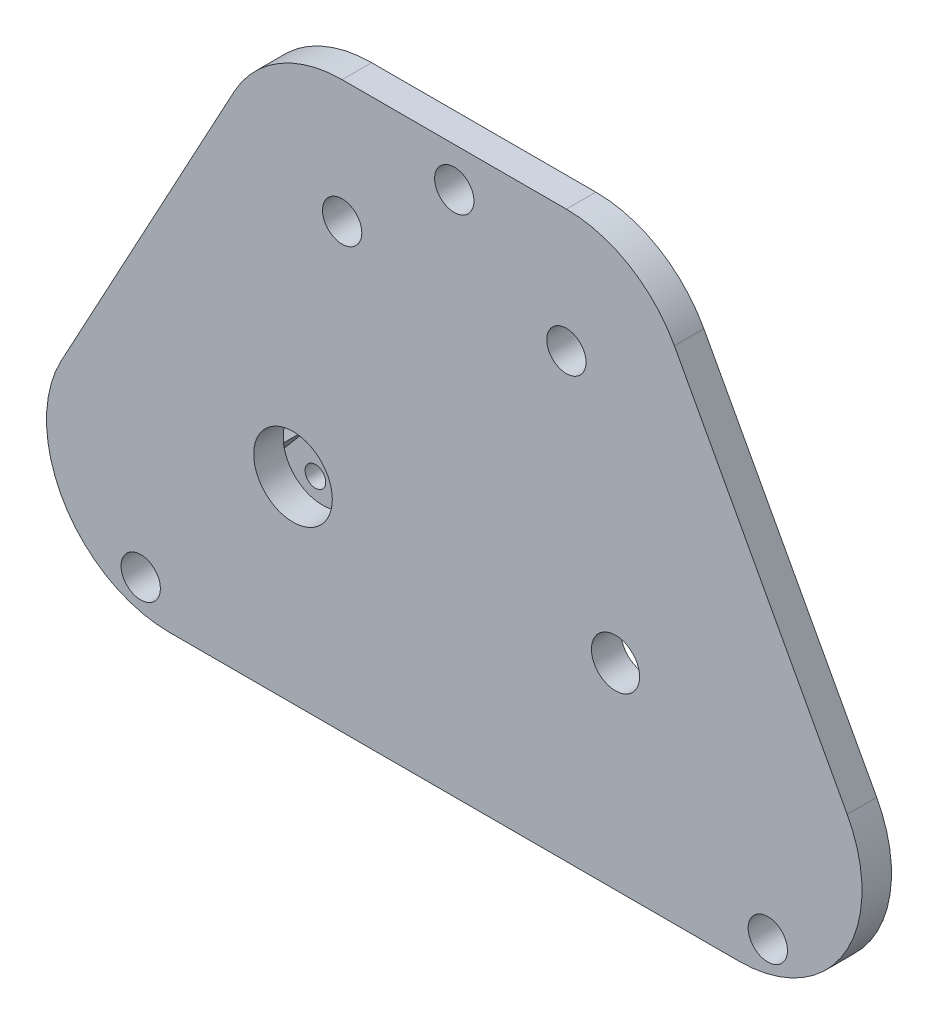
ISO-10303-21;
HEADER;
FILE_DESCRIPTION(('STEP AP214'),'2;1');
FILE_NAME('part.step','',(''),(''),'','','');
FILE_SCHEMA(('AUTOMOTIVE_DESIGN { 1 0 10303 214 1 1 1 1 }'));
ENDSEC;
DATA;
#1=APPLICATION_CONTEXT('core data for automotive mechanical design processes');
#2=APPLICATION_PROTOCOL_DEFINITION('international standard','automotive_design',2000,#1);
#3=PRODUCT_CONTEXT('',#1,'mechanical');
#4=PRODUCT('Part','Part','',(#3));
#5=PRODUCT_RELATED_PRODUCT_CATEGORY('part','',(#4));
#6=PRODUCT_DEFINITION_FORMATION('','',#4);
#7=PRODUCT_DEFINITION_CONTEXT('part definition',#1,'design');
#8=PRODUCT_DEFINITION('design','',#6,#7);
#9=PRODUCT_DEFINITION_SHAPE('','',#8);
#10=(LENGTH_UNIT() NAMED_UNIT(*) SI_UNIT(.MILLI.,.METRE.));
#11=(NAMED_UNIT(*) PLANE_ANGLE_UNIT() SI_UNIT($,.RADIAN.));
#12=(NAMED_UNIT(*) SI_UNIT($,.STERADIAN.) SOLID_ANGLE_UNIT());
#13=UNCERTAINTY_MEASURE_WITH_UNIT(LENGTH_MEASURE(1.E-05),#10,'distance_accuracy_value','');
#14=(GEOMETRIC_REPRESENTATION_CONTEXT(3) GLOBAL_UNCERTAINTY_ASSIGNED_CONTEXT((#13)) GLOBAL_UNIT_ASSIGNED_CONTEXT((#10,
#11,#12)) REPRESENTATION_CONTEXT('',''));
#15=CARTESIAN_POINT('',(0.,0.,0.));
#16=DIRECTION('',(0.,0.,1.));
#17=DIRECTION('',(1.,0.,0.));
#18=AXIS2_PLACEMENT_3D('',#15,#16,#17);
#19=CARTESIAN_POINT('',(11.41,25.,3.));
#20=DIRECTION('',(0.,0.,-1.));
#21=DIRECTION('',(-1.,0.,0.));
#22=AXIS2_PLACEMENT_3D('',#19,#20,#21);
#23=CYLINDRICAL_SURFACE('',#22,12.5);
#24=CARTESIAN_POINT('',(11.41,25.,0.));
#25=DIRECTION('',(0.,0.,1.));
#26=DIRECTION('',(1.,0.,0.));
#27=AXIS2_PLACEMENT_3D('',#24,#25,#26);
#28=CIRCLE('',#27,12.5);
#29=CARTESIAN_POINT('',(22.4037432028954,30.9487486405791,0.));
#30=VERTEX_POINT('',#29);
#31=CARTESIAN_POINT('',(11.41,37.5,0.));
#32=VERTEX_POINT('',#31);
#33=EDGE_CURVE('E336',#30,#32,#28,.T.);
#34=ORIENTED_EDGE('',*,*,#33,.T.);
#35=DIRECTION('',(0.,0.,-1.));
#36=VECTOR('',#35,1.);
#37=CARTESIAN_POINT('',(11.41,37.5,3.));
#38=LINE('',#37,#36);
#39=CARTESIAN_POINT('',(11.41,37.5,3.));
#40=VERTEX_POINT('',#39);
#41=EDGE_CURVE('E11',#40,#32,#38,.T.);
#42=ORIENTED_EDGE('',*,*,#41,.F.);
#43=CARTESIAN_POINT('',(11.41,25.,3.));
#44=DIRECTION('',(0.,0.,1.));
#45=DIRECTION('',(1.,0.,0.));
#46=AXIS2_PLACEMENT_3D('',#43,#44,#45);
#47=CIRCLE('',#46,12.5);
#48=CARTESIAN_POINT('',(22.4037432028954,30.9487486405791,3.));
#49=VERTEX_POINT('',#48);
#50=EDGE_CURVE('E337',#49,#40,#47,.T.);
#51=ORIENTED_EDGE('',*,*,#50,.F.);
#52=DIRECTION('',(0.,0.,-1.));
#53=VECTOR('',#52,1.);
#54=CARTESIAN_POINT('',(22.4037432028954,30.9487486405791,3.));
#55=LINE('',#54,#53);
#56=EDGE_CURVE('E377',#49,#30,#55,.T.);
#57=ORIENTED_EDGE('',*,*,#56,.T.);
#58=EDGE_LOOP('',(#34,#42,#51,#57));
#59=FACE_BOUND('',#58,.T.);
#60=ADVANCED_FACE('F44',(#59),#23,.T.);
#61=CARTESIAN_POINT('',(0.,37.5,3.));
#62=DIRECTION('',(0.,1.,0.));
#63=DIRECTION('',(-1.,0.,0.));
#64=AXIS2_PLACEMENT_3D('',#61,#62,#63);
#65=PLANE('',#64);
#66=DIRECTION('',(1.,0.,0.));
#67=VECTOR('',#66,1.);
#68=CARTESIAN_POINT('',(0.,37.5,0.));
#69=LINE('',#68,#67);
#70=CARTESIAN_POINT('',(-11.41,37.5,0.));
#71=VERTEX_POINT('',#70);
#72=EDGE_CURVE('E380',#71,#32,#69,.T.);
#73=ORIENTED_EDGE('',*,*,#72,.F.);
#74=DIRECTION('',(0.,0.,-1.));
#75=VECTOR('',#74,1.);
#76=CARTESIAN_POINT('',(-11.41,37.5,3.));
#77=LINE('',#76,#75);
#78=CARTESIAN_POINT('',(-11.41,37.5,3.));
#79=VERTEX_POINT('',#78);
#80=EDGE_CURVE('E51',#79,#71,#77,.T.);
#81=ORIENTED_EDGE('',*,*,#80,.F.);
#82=DIRECTION('',(1.,0.,0.));
#83=VECTOR('',#82,1.);
#84=CARTESIAN_POINT('',(0.,37.5,3.));
#85=LINE('',#84,#83);
#86=EDGE_CURVE('E339',#79,#40,#85,.T.);
#87=ORIENTED_EDGE('',*,*,#86,.T.);
#88=ORIENTED_EDGE('',*,*,#41,.T.);
#89=EDGE_LOOP('',(#73,#81,#87,#88));
#90=FACE_BOUND('',#89,.T.);
#91=ADVANCED_FACE('F444',(#90),#65,.T.);
#92=CARTESIAN_POINT('',(-11.41,25.,3.));
#93=DIRECTION('',(0.,0.,-1.));
#94=DIRECTION('',(-1.,0.,0.));
#95=AXIS2_PLACEMENT_3D('',#92,#93,#94);
#96=CYLINDRICAL_SURFACE('',#95,12.5);
#97=CARTESIAN_POINT('',(-11.41,25.,0.));
#98=DIRECTION('',(0.,0.,1.));
#99=DIRECTION('',(1.,0.,0.));
#100=AXIS2_PLACEMENT_3D('',#97,#98,#99);
#101=CIRCLE('',#100,12.5);
#102=CARTESIAN_POINT('',(-22.4037432028954,30.9487486405791,0.));
#103=VERTEX_POINT('',#102);
#104=EDGE_CURVE('E383',#71,#103,#101,.T.);
#105=ORIENTED_EDGE('',*,*,#104,.T.);
#106=DIRECTION('',(0.,0.,-1.));
#107=VECTOR('',#106,1.);
#108=CARTESIAN_POINT('',(-22.4037432028954,30.9487486405791,3.));
#109=LINE('',#108,#107);
#110=CARTESIAN_POINT('',(-22.4037432028954,30.9487486405791,3.));
#111=VERTEX_POINT('',#110);
#112=EDGE_CURVE('E429',#111,#103,#109,.T.);
#113=ORIENTED_EDGE('',*,*,#112,.F.);
#114=CARTESIAN_POINT('',(-11.41,25.,3.));
#115=DIRECTION('',(0.,0.,1.));
#116=DIRECTION('',(1.,0.,0.));
#117=AXIS2_PLACEMENT_3D('',#114,#115,#116);
#118=CIRCLE('',#117,12.5);
#119=EDGE_CURVE('E343',#79,#111,#118,.T.);
#120=ORIENTED_EDGE('',*,*,#119,.F.);
#121=ORIENTED_EDGE('',*,*,#80,.T.);
#122=EDGE_LOOP('',(#105,#113,#120,#121));
#123=FACE_BOUND('',#122,.T.);
#124=ADVANCED_FACE('F434',(#123),#96,.T.);
#125=CARTESIAN_POINT('',(-30.2834407311602,16.3864639692604,3.));
#126=DIRECTION('',(0.879499456231631,-0.475899891246327,0.));
#127=DIRECTION('',(0.475899891246327,0.879499456231631,0.));
#128=AXIS2_PLACEMENT_3D('',#125,#126,#127);
#129=PLANE('',#128);
#130=DIRECTION('',(-0.475899891246327,-0.879499456231631,0.));
#131=VECTOR('',#130,1.);
#132=CARTESIAN_POINT('',(-30.2834407311602,16.3864639692604,0.));
#133=LINE('',#132,#131);
#134=CARTESIAN_POINT('',(-39.9895942866193,-1.55125135942092,0.));
#135=VERTEX_POINT('',#134);
#136=EDGE_CURVE('E385',#103,#135,#133,.T.);
#137=ORIENTED_EDGE('',*,*,#136,.T.);
#138=DIRECTION('',(0.,0.,-1.));
#139=VECTOR('',#138,1.);
#140=CARTESIAN_POINT('',(-39.9895942866193,-1.55125135942092,3.));
#141=LINE('',#140,#139);
#142=CARTESIAN_POINT('',(-39.9895942866193,-1.55125135942092,3.));
#143=VERTEX_POINT('',#142);
#144=EDGE_CURVE('E426',#143,#135,#141,.T.);
#145=ORIENTED_EDGE('',*,*,#144,.F.);
#146=DIRECTION('',(-0.475899891246327,-0.879499456231631,0.));
#147=VECTOR('',#146,1.);
#148=CARTESIAN_POINT('',(-30.2834407311602,16.3864639692604,3.));
#149=LINE('',#148,#147);
#150=EDGE_CURVE('E345',#111,#143,#149,.T.);
#151=ORIENTED_EDGE('',*,*,#150,.F.);
#152=ORIENTED_EDGE('',*,*,#112,.T.);
#153=EDGE_LOOP('',(#137,#145,#151,#152));
#154=FACE_BOUND('',#153,.T.);
#155=ADVANCED_FACE('F468',(#154),#129,.F.);
#156=CARTESIAN_POINT('',(-28.9958510837239,-7.5,3.));
#157=DIRECTION('',(0.,0.,-1.));
#158=DIRECTION('',(-1.,0.,0.));
#159=AXIS2_PLACEMENT_3D('',#156,#157,#158);
#160=CYLINDRICAL_SURFACE('',#159,12.5);
#161=CARTESIAN_POINT('',(-28.9958510837239,-7.5,0.));
#162=DIRECTION('',(0.,0.,1.));
#163=DIRECTION('',(1.,0.,0.));
#164=AXIS2_PLACEMENT_3D('',#161,#162,#163);
#165=CIRCLE('',#164,12.5);
#166=CARTESIAN_POINT('',(-28.9958510837239,-20.,0.));
#167=VERTEX_POINT('',#166);
#168=EDGE_CURVE('E387',#135,#167,#165,.T.);
#169=ORIENTED_EDGE('',*,*,#168,.T.);
#170=DIRECTION('',(0.,0.,-1.));
#171=VECTOR('',#170,1.);
#172=CARTESIAN_POINT('',(-28.9958510837239,-20.,3.));
#173=LINE('',#172,#171);
#174=CARTESIAN_POINT('',(-28.9958510837239,-20.,3.));
#175=VERTEX_POINT('',#174);
#176=EDGE_CURVE('E423',#175,#167,#173,.T.);
#177=ORIENTED_EDGE('',*,*,#176,.F.);
#178=CARTESIAN_POINT('',(-28.9958510837239,-7.5,3.));
#179=DIRECTION('',(0.,0.,1.));
#180=DIRECTION('',(1.,0.,0.));
#181=AXIS2_PLACEMENT_3D('',#178,#179,#180);
#182=CIRCLE('',#181,12.5);
#183=EDGE_CURVE('E347',#143,#175,#182,.T.);
#184=ORIENTED_EDGE('',*,*,#183,.F.);
#185=ORIENTED_EDGE('',*,*,#144,.T.);
#186=EDGE_LOOP('',(#169,#177,#184,#185));
#187=FACE_BOUND('',#186,.T.);
#188=ADVANCED_FACE('F463',(#187),#160,.T.);
#189=CARTESIAN_POINT('',(0.,-20.,3.));
#190=DIRECTION('',(0.,1.,0.));
#191=DIRECTION('',(-1.,0.,0.));
#192=AXIS2_PLACEMENT_3D('',#189,#190,#191);
#193=PLANE('',#192);
#194=DIRECTION('',(1.,0.,0.));
#195=VECTOR('',#194,1.);
#196=CARTESIAN_POINT('',(0.,-20.,0.));
#197=LINE('',#196,#195);
#198=CARTESIAN_POINT('',(28.9958510837239,-20.,0.));
#199=VERTEX_POINT('',#198);
#200=EDGE_CURVE('E389',#167,#199,#197,.T.);
#201=ORIENTED_EDGE('',*,*,#200,.T.);
#202=DIRECTION('',(0.,0.,-1.));
#203=VECTOR('',#202,1.);
#204=CARTESIAN_POINT('',(28.9958510837239,-20.,3.));
#205=LINE('',#204,#203);
#206=CARTESIAN_POINT('',(28.9958510837239,-20.,3.));
#207=VERTEX_POINT('',#206);
#208=EDGE_CURVE('E421',#207,#199,#205,.T.);
#209=ORIENTED_EDGE('',*,*,#208,.F.);
#210=DIRECTION('',(1.,0.,0.));
#211=VECTOR('',#210,1.);
#212=CARTESIAN_POINT('',(0.,-20.,3.));
#213=LINE('',#212,#211);
#214=EDGE_CURVE('E349',#175,#207,#213,.T.);
#215=ORIENTED_EDGE('',*,*,#214,.F.);
#216=ORIENTED_EDGE('',*,*,#176,.T.);
#217=EDGE_LOOP('',(#201,#209,#215,#216));
#218=FACE_BOUND('',#217,.T.);
#219=ADVANCED_FACE('F460',(#218),#193,.F.);
#220=CARTESIAN_POINT('',(28.9958510837239,-7.5,3.));
#221=DIRECTION('',(0.,0.,-1.));
#222=DIRECTION('',(-1.,0.,0.));
#223=AXIS2_PLACEMENT_3D('',#220,#221,#222);
#224=CYLINDRICAL_SURFACE('',#223,12.5);
#225=CARTESIAN_POINT('',(28.9958510837239,-7.5,0.));
#226=DIRECTION('',(0.,0.,1.));
#227=DIRECTION('',(1.,0.,0.));
#228=AXIS2_PLACEMENT_3D('',#225,#226,#227);
#229=CIRCLE('',#228,12.5);
#230=CARTESIAN_POINT('',(39.9895942866193,-1.55125135942092,0.));
#231=VERTEX_POINT('',#230);
#232=EDGE_CURVE('E392',#231,#199,#229,.F.);
#233=ORIENTED_EDGE('',*,*,#232,.F.);
#234=DIRECTION('',(0.,0.,-1.));
#235=VECTOR('',#234,1.);
#236=CARTESIAN_POINT('',(39.9895942866193,-1.55125135942092,3.));
#237=LINE('',#236,#235);
#238=CARTESIAN_POINT('',(39.9895942866193,-1.55125135942092,3.));
#239=VERTEX_POINT('',#238);
#240=EDGE_CURVE('E419',#239,#231,#237,.T.);
#241=ORIENTED_EDGE('',*,*,#240,.F.);
#242=CARTESIAN_POINT('',(28.9958510837239,-7.5,3.));
#243=DIRECTION('',(0.,0.,1.));
#244=DIRECTION('',(1.,0.,0.));
#245=AXIS2_PLACEMENT_3D('',#242,#243,#244);
#246=CIRCLE('',#245,12.5);
#247=EDGE_CURVE('E351',#239,#207,#246,.F.);
#248=ORIENTED_EDGE('',*,*,#247,.T.);
#249=ORIENTED_EDGE('',*,*,#208,.T.);
#250=EDGE_LOOP('',(#233,#241,#248,#249));
#251=FACE_BOUND('',#250,.T.);
#252=ADVANCED_FACE('F454',(#251),#224,.T.);
#253=CARTESIAN_POINT('',(-31.91,-16.6,3.));
#254=DIRECTION('',(0.,0.,-1.));
#255=DIRECTION('',(-1.,0.,0.));
#256=AXIS2_PLACEMENT_3D('',#253,#254,#255);
#257=CYLINDRICAL_SURFACE('',#256,2.);
#258=CARTESIAN_POINT('',(-31.91,-16.6,3.));
#259=DIRECTION('',(0.,0.,1.));
#260=DIRECTION('',(1.,0.,0.));
#261=AXIS2_PLACEMENT_3D('',#258,#259,#260);
#262=CIRCLE('',#261,2.);
#263=CARTESIAN_POINT('',(-29.91,-16.6,3.));
#264=VERTEX_POINT('',#263);
#265=EDGE_CURVE('E371',#264,#264,#262,.F.);
#266=ORIENTED_EDGE('',*,*,#265,.F.);
#267=EDGE_LOOP('',(#266));
#268=FACE_BOUND('',#267,.T.);
#269=CARTESIAN_POINT('',(-31.91,-16.6,0.));
#270=DIRECTION('',(0.,0.,1.));
#271=DIRECTION('',(1.,0.,0.));
#272=AXIS2_PLACEMENT_3D('',#269,#270,#271);
#273=CIRCLE('',#272,2.);
#274=CARTESIAN_POINT('',(-29.91,-16.6,0.));
#275=VERTEX_POINT('',#274);
#276=EDGE_CURVE('E412',#275,#275,#273,.F.);
#277=ORIENTED_EDGE('',*,*,#276,.T.);
#278=EDGE_LOOP('',(#277));
#279=FACE_BOUND('',#278,.T.);
#280=ADVANCED_FACE('F502',(#268,#279),#257,.F.);
#281=CARTESIAN_POINT('',(31.91,-16.6,3.));
#282=DIRECTION('',(0.,0.,-1.));
#283=DIRECTION('',(-1.,0.,0.));
#284=AXIS2_PLACEMENT_3D('',#281,#282,#283);
#285=CYLINDRICAL_SURFACE('',#284,2.);
#286=CARTESIAN_POINT('',(31.91,-16.6,3.));
#287=DIRECTION('',(0.,0.,1.));
#288=DIRECTION('',(1.,0.,0.));
#289=AXIS2_PLACEMENT_3D('',#286,#287,#288);
#290=CIRCLE('',#289,2.);
#291=CARTESIAN_POINT('',(33.91,-16.6,3.));
#292=VERTEX_POINT('',#291);
#293=EDGE_CURVE('E368',#292,#292,#290,.T.);
#294=ORIENTED_EDGE('',*,*,#293,.T.);
#295=EDGE_LOOP('',(#294));
#296=FACE_BOUND('',#295,.T.);
#297=CARTESIAN_POINT('',(31.91,-16.6,0.));
#298=DIRECTION('',(0.,0.,1.));
#299=DIRECTION('',(1.,0.,0.));
#300=AXIS2_PLACEMENT_3D('',#297,#298,#299);
#301=CIRCLE('',#300,2.);
#302=CARTESIAN_POINT('',(33.91,-16.6,0.));
#303=VERTEX_POINT('',#302);
#304=EDGE_CURVE('E409',#303,#303,#301,.T.);
#305=ORIENTED_EDGE('',*,*,#304,.F.);
#306=EDGE_LOOP('',(#305));
#307=FACE_BOUND('',#306,.T.);
#308=ADVANCED_FACE('F506',(#296,#307),#285,.F.);
#309=CARTESIAN_POINT('',(11.41,25.,3.));
#310=DIRECTION('',(0.,0.,-1.));
#311=DIRECTION('',(-1.,0.,0.));
#312=AXIS2_PLACEMENT_3D('',#309,#310,#311);
#313=CYLINDRICAL_SURFACE('',#312,2.);
#314=CARTESIAN_POINT('',(11.41,25.,3.));
#315=DIRECTION('',(0.,0.,1.));
#316=DIRECTION('',(1.,0.,0.));
#317=AXIS2_PLACEMENT_3D('',#314,#315,#316);
#318=CIRCLE('',#317,2.);
#319=CARTESIAN_POINT('',(13.41,25.,3.));
#320=VERTEX_POINT('',#319);
#321=EDGE_CURVE('E365',#320,#320,#318,.T.);
#322=ORIENTED_EDGE('',*,*,#321,.T.);
#323=EDGE_LOOP('',(#322));
#324=FACE_BOUND('',#323,.T.);
#325=CARTESIAN_POINT('',(11.41,25.,0.));
#326=DIRECTION('',(0.,0.,1.));
#327=DIRECTION('',(1.,0.,0.));
#328=AXIS2_PLACEMENT_3D('',#325,#326,#327);
#329=CIRCLE('',#328,2.);
#330=CARTESIAN_POINT('',(13.41,25.,0.));
#331=VERTEX_POINT('',#330);
#332=EDGE_CURVE('E406',#331,#331,#329,.T.);
#333=ORIENTED_EDGE('',*,*,#332,.F.);
#334=EDGE_LOOP('',(#333));
#335=FACE_BOUND('',#334,.T.);
#336=ADVANCED_FACE('F512',(#324,#335),#313,.F.);
#337=CARTESIAN_POINT('',(-11.41,25.,3.));
#338=DIRECTION('',(0.,0.,-1.));
#339=DIRECTION('',(-1.,0.,0.));
#340=AXIS2_PLACEMENT_3D('',#337,#338,#339);
#341=CYLINDRICAL_SURFACE('',#340,2.);
#342=CARTESIAN_POINT('',(-11.41,25.,3.));
#343=DIRECTION('',(0.,0.,1.));
#344=DIRECTION('',(1.,0.,0.));
#345=AXIS2_PLACEMENT_3D('',#342,#343,#344);
#346=CIRCLE('',#345,2.);
#347=CARTESIAN_POINT('',(-9.41,25.,3.));
#348=VERTEX_POINT('',#347);
#349=EDGE_CURVE('E362',#348,#348,#346,.T.);
#350=ORIENTED_EDGE('',*,*,#349,.T.);
#351=EDGE_LOOP('',(#350));
#352=FACE_BOUND('',#351,.T.);
#353=CARTESIAN_POINT('',(-11.41,25.,0.));
#354=DIRECTION('',(0.,0.,1.));
#355=DIRECTION('',(1.,0.,0.));
#356=AXIS2_PLACEMENT_3D('',#353,#354,#355);
#357=CIRCLE('',#356,2.);
#358=CARTESIAN_POINT('',(-9.41,25.,0.));
#359=VERTEX_POINT('',#358);
#360=EDGE_CURVE('E403',#359,#359,#357,.T.);
#361=ORIENTED_EDGE('',*,*,#360,.F.);
#362=EDGE_LOOP('',(#361));
#363=FACE_BOUND('',#362,.T.);
#364=ADVANCED_FACE('F521',(#352,#363),#341,.F.);
#365=CARTESIAN_POINT('',(16.41,0.,3.));
#366=DIRECTION('',(0.,0.,-1.));
#367=DIRECTION('',(-1.,0.,0.));
#368=AXIS2_PLACEMENT_3D('',#365,#366,#367);
#369=CYLINDRICAL_SURFACE('',#368,2.45);
#370=CARTESIAN_POINT('',(16.41,0.,3.));
#371=DIRECTION('',(0.,0.,1.));
#372=DIRECTION('',(1.,0.,0.));
#373=AXIS2_PLACEMENT_3D('',#370,#371,#372);
#374=CIRCLE('',#373,2.45);
#375=CARTESIAN_POINT('',(18.86,0.,3.));
#376=VERTEX_POINT('',#375);
#377=EDGE_CURVE('E359',#376,#376,#374,.T.);
#378=ORIENTED_EDGE('',*,*,#377,.T.);
#379=EDGE_LOOP('',(#378));
#380=FACE_BOUND('',#379,.T.);
#381=CARTESIAN_POINT('',(16.41,0.,0.));
#382=DIRECTION('',(0.,0.,1.));
#383=DIRECTION('',(1.,0.,0.));
#384=AXIS2_PLACEMENT_3D('',#381,#382,#383);
#385=CIRCLE('',#384,2.45);
#386=CARTESIAN_POINT('',(18.86,0.,0.));
#387=VERTEX_POINT('',#386);
#388=EDGE_CURVE('E400',#387,#387,#385,.T.);
#389=ORIENTED_EDGE('',*,*,#388,.F.);
#390=EDGE_LOOP('',(#389));
#391=FACE_BOUND('',#390,.T.);
#392=ADVANCED_FACE('F483',(#380,#391),#369,.F.);
#393=CARTESIAN_POINT('',(-16.41,0.,3.));
#394=DIRECTION('',(0.,0.,-1.));
#395=DIRECTION('',(-1.,0.,0.));
#396=AXIS2_PLACEMENT_3D('',#393,#394,#395);
#397=CYLINDRICAL_SURFACE('',#396,4.);
#398=CARTESIAN_POINT('',(-16.41,0.,3.));
#399=DIRECTION('',(0.,0.,1.));
#400=DIRECTION('',(1.,0.,0.));
#401=AXIS2_PLACEMENT_3D('',#398,#399,#400);
#402=CIRCLE('',#401,4.);
#403=CARTESIAN_POINT('',(-12.41,0.,3.));
#404=VERTEX_POINT('',#403);
#405=EDGE_CURVE('E356',#404,#404,#402,.T.);
#406=ORIENTED_EDGE('',*,*,#405,.T.);
#407=EDGE_LOOP('',(#406));
#408=FACE_BOUND('',#407,.T.);
#409=CARTESIAN_POINT('',(-16.41,0.,0.));
#410=DIRECTION('',(0.,0.,1.));
#411=DIRECTION('',(1.,0.,0.));
#412=AXIS2_PLACEMENT_3D('',#409,#410,#411);
#413=CIRCLE('',#412,4.);
#414=CARTESIAN_POINT('',(-12.41,0.,0.));
#415=VERTEX_POINT('',#414);
#416=EDGE_CURVE('E397',#415,#415,#413,.T.);
#417=ORIENTED_EDGE('',*,*,#416,.F.);
#418=EDGE_LOOP('',(#417));
#419=FACE_BOUND('',#418,.T.);
#420=ADVANCED_FACE('F475',(#408,#419),#397,.F.);
#421=CARTESIAN_POINT('',(30.2834407311602,16.3864639692604,3.));
#422=DIRECTION('',(-0.879499456231631,-0.475899891246326,0.));
#423=DIRECTION('',(0.475899891246326,-0.879499456231631,0.));
#424=AXIS2_PLACEMENT_3D('',#421,#422,#423);
#425=PLANE('',#424);
#426=DIRECTION('',(-0.475899891246326,0.879499456231631,0.));
#427=VECTOR('',#426,1.);
#428=CARTESIAN_POINT('',(30.2834407311602,16.3864639692604,0.));
#429=LINE('',#428,#427);
#430=EDGE_CURVE('E395',#231,#30,#429,.T.);
#431=ORIENTED_EDGE('',*,*,#430,.T.);
#432=ORIENTED_EDGE('',*,*,#56,.F.);
#433=DIRECTION('',(-0.475899891246326,0.879499456231631,0.));
#434=VECTOR('',#433,1.);
#435=CARTESIAN_POINT('',(30.2834407311602,16.3864639692604,3.));
#436=LINE('',#435,#434);
#437=EDGE_CURVE('E354',#239,#49,#436,.T.);
#438=ORIENTED_EDGE('',*,*,#437,.F.);
#439=ORIENTED_EDGE('',*,*,#240,.T.);
#440=EDGE_LOOP('',(#431,#432,#438,#439));
#441=FACE_BOUND('',#440,.T.);
#442=ADVANCED_FACE('F472',(#441),#425,.F.);
#443=CARTESIAN_POINT('',(0.,33.5,3.));
#444=DIRECTION('',(0.,0.,-1.));
#445=DIRECTION('',(-1.,0.,0.));
#446=AXIS2_PLACEMENT_3D('',#443,#444,#445);
#447=CYLINDRICAL_SURFACE('',#446,2.);
#448=CARTESIAN_POINT('',(0.,33.5,3.));
#449=DIRECTION('',(0.,0.,1.));
#450=DIRECTION('',(1.,0.,0.));
#451=AXIS2_PLACEMENT_3D('',#448,#449,#450);
#452=CIRCLE('',#451,2.);
#453=CARTESIAN_POINT('',(2.,33.5,3.));
#454=VERTEX_POINT('',#453);
#455=EDGE_CURVE('E374',#454,#454,#452,.T.);
#456=ORIENTED_EDGE('',*,*,#455,.T.);
#457=EDGE_LOOP('',(#456));
#458=FACE_BOUND('',#457,.T.);
#459=CARTESIAN_POINT('',(0.,33.5,0.));
#460=DIRECTION('',(0.,0.,1.));
#461=DIRECTION('',(1.,0.,0.));
#462=AXIS2_PLACEMENT_3D('',#459,#460,#461);
#463=CIRCLE('',#462,2.);
#464=CARTESIAN_POINT('',(2.,33.5,0.));
#465=VERTEX_POINT('',#464);
#466=EDGE_CURVE('E340',#465,#465,#463,.T.);
#467=ORIENTED_EDGE('',*,*,#466,.F.);
#468=EDGE_LOOP('',(#467));
#469=FACE_BOUND('',#468,.T.);
#470=ADVANCED_FACE('F474',(#458,#469),#447,.F.);
#471=CARTESIAN_POINT('',(0.,0.,3.));
#472=DIRECTION('',(0.,0.,1.));
#473=DIRECTION('',(1.,0.,0.));
#474=AXIS2_PLACEMENT_3D('',#471,#472,#473);
#475=PLANE('',#474);
#476=ORIENTED_EDGE('',*,*,#50,.T.);
#477=ORIENTED_EDGE('',*,*,#86,.F.);
#478=ORIENTED_EDGE('',*,*,#119,.T.);
#479=ORIENTED_EDGE('',*,*,#150,.T.);
#480=ORIENTED_EDGE('',*,*,#183,.T.);
#481=ORIENTED_EDGE('',*,*,#214,.T.);
#482=ORIENTED_EDGE('',*,*,#247,.F.);
#483=ORIENTED_EDGE('',*,*,#437,.T.);
#484=EDGE_LOOP('',(#476,#477,#478,#479,#480,#481,#482,#483));
#485=FACE_BOUND('',#484,.T.);
#486=ORIENTED_EDGE('',*,*,#405,.F.);
#487=EDGE_LOOP('',(#486));
#488=FACE_BOUND('',#487,.T.);
#489=ORIENTED_EDGE('',*,*,#377,.F.);
#490=EDGE_LOOP('',(#489));
#491=FACE_BOUND('',#490,.T.);
#492=ORIENTED_EDGE('',*,*,#349,.F.);
#493=EDGE_LOOP('',(#492));
#494=FACE_BOUND('',#493,.T.);
#495=ORIENTED_EDGE('',*,*,#321,.F.);
#496=EDGE_LOOP('',(#495));
#497=FACE_BOUND('',#496,.T.);
#498=ORIENTED_EDGE('',*,*,#293,.F.);
#499=EDGE_LOOP('',(#498));
#500=FACE_BOUND('',#499,.T.);
#501=ORIENTED_EDGE('',*,*,#265,.T.);
#502=EDGE_LOOP('',(#501));
#503=FACE_BOUND('',#502,.T.);
#504=ORIENTED_EDGE('',*,*,#455,.F.);
#505=EDGE_LOOP('',(#504));
#506=FACE_BOUND('',#505,.T.);
#507=ADVANCED_FACE('F470',(#485,#488,#491,#494,#497,#500,#503,#506),#475,.T.);
#508=CARTESIAN_POINT('',(7.00757752553344,8.35130569143681,-8.3));
#509=DIRECTION('',(-0.642787609686544,-0.766044443118974,0.));
#510=DIRECTION('',(0.766044443118974,-0.642787609686544,0.));
#511=AXIS2_PLACEMENT_3D('',#508,#509,#510);
#512=PLANE('',#511);
#513=DIRECTION('',(0.766044443118974,-0.642787609686544,0.));
#514=VECTOR('',#513,1.);
#515=CARTESIAN_POINT('',(7.00757752553344,8.35130569143681,-5.));
#516=LINE('',#515,#514);
#517=CARTESIAN_POINT('',(-4.92033910158053,18.3600161339616,-5.));
#518=VERTEX_POINT('',#517);
#519=CARTESIAN_POINT('',(-0.324072442866688,14.5032904758424,-5.));
#520=VERTEX_POINT('',#519);
#521=EDGE_CURVE('E624',#518,#520,#516,.T.);
#522=ORIENTED_EDGE('',*,*,#521,.T.);
#523=DIRECTION('',(0.,0.,1.));
#524=VECTOR('',#523,1.);
#525=CARTESIAN_POINT('',(-0.324072442866688,14.5032904758424,-5.));
#526=LINE('',#525,#524);
#527=CARTESIAN_POINT('',(-0.324072442866688,14.5032904758424,0.));
#528=VERTEX_POINT('',#527);
#529=EDGE_CURVE('E220',#520,#528,#526,.T.);
#530=ORIENTED_EDGE('',*,*,#529,.T.);
#531=DIRECTION('',(0.766044443118974,-0.642787609686544,0.));
#532=VECTOR('',#531,1.);
#533=CARTESIAN_POINT('',(7.00757752553344,8.35130569143681,0.));
#534=LINE('',#533,#532);
#535=CARTESIAN_POINT('',(2.08896755295805,12.4785095053298,0.));
#536=VERTEX_POINT('',#535);
#537=EDGE_CURVE('E301',#528,#536,#534,.T.);
#538=ORIENTED_EDGE('',*,*,#537,.T.);
#539=DIRECTION('',(0.,0.,1.));
#540=VECTOR('',#539,1.);
#541=CARTESIAN_POINT('',(2.08896755295804,12.4785095053298,-8.3));
#542=LINE('',#541,#540);
#543=CARTESIAN_POINT('',(2.08896755295804,12.4785095053298,-8.3));
#544=VERTEX_POINT('',#543);
#545=EDGE_CURVE('E333',#544,#536,#542,.T.);
#546=ORIENTED_EDGE('',*,*,#545,.F.);
#547=DIRECTION('',(0.766044443118974,-0.642787609686544,0.));
#548=VECTOR('',#547,1.);
#549=CARTESIAN_POINT('',(7.00757752553344,8.35130569143681,-8.3));
#550=LINE('',#549,#548);
#551=CARTESIAN_POINT('',(-7.33337909740527,20.3847971044742,-8.3));
#552=VERTEX_POINT('',#551);
#553=EDGE_CURVE('E305',#552,#544,#550,.T.);
#554=ORIENTED_EDGE('',*,*,#553,.F.);
#555=DIRECTION('',(0.,0.,1.));
#556=VECTOR('',#555,1.);
#557=CARTESIAN_POINT('',(-7.33337909740527,20.3847971044742,-8.3));
#558=LINE('',#557,#556);
#559=CARTESIAN_POINT('',(-7.33337909740527,20.3847971044742,0.));
#560=VERTEX_POINT('',#559);
#561=EDGE_CURVE('E315',#552,#560,#558,.T.);
#562=ORIENTED_EDGE('',*,*,#561,.T.);
#563=CARTESIAN_POINT('',(-4.92033910158053,18.3600161339616,0.));
#564=VERTEX_POINT('',#563);
#565=EDGE_CURVE('E316',#560,#564,#534,.T.);
#566=ORIENTED_EDGE('',*,*,#565,.T.);
#567=DIRECTION('',(0.,0.,1.));
#568=VECTOR('',#567,1.);
#569=CARTESIAN_POINT('',(-4.92033910158053,18.3600161339616,-5.));
#570=LINE('',#569,#568);
#571=EDGE_CURVE('E231',#518,#564,#570,.T.);
#572=ORIENTED_EDGE('',*,*,#571,.F.);
#573=EDGE_LOOP('',(#522,#530,#538,#546,#554,#562,#566,#572));
#574=FACE_BOUND('',#573,.T.);
#575=ADVANCED_FACE('F547',(#574),#512,.F.);
#576=CARTESIAN_POINT('',(-4.91860997257539,4.12720381389296,-8.3));
#577=DIRECTION('',(-0.766044443118974,0.642787609686544,0.));
#578=DIRECTION('',(-0.642787609686544,-0.766044443118974,0.));
#579=AXIS2_PLACEMENT_3D('',#576,#577,#578);
#580=PLANE('',#579);
#581=DIRECTION('',(-0.642787609686544,-0.766044443118974,0.));
#582=VECTOR('',#581,1.);
#583=CARTESIAN_POINT('',(-4.91860997257539,4.12720381389296,0.));
#584=LINE('',#583,#582);
#585=CARTESIAN_POINT('',(-1.06069173450602,8.7248917340468,0.));
#586=VERTEX_POINT('',#585);
#587=EDGE_CURVE('E319',#536,#586,#584,.T.);
#588=ORIENTED_EDGE('',*,*,#587,.T.);
#589=DIRECTION('',(0.,0.,1.));
#590=VECTOR('',#589,1.);
#591=CARTESIAN_POINT('',(-1.06069173450602,8.7248917340468,-8.3));
#592=LINE('',#591,#590);
#593=CARTESIAN_POINT('',(-1.06069173450602,8.7248917340468,-8.3));
#594=VERTEX_POINT('',#593);
#595=EDGE_CURVE('E331',#594,#586,#592,.T.);
#596=ORIENTED_EDGE('',*,*,#595,.F.);
#597=DIRECTION('',(-0.642787609686544,-0.766044443118974,0.));
#598=VECTOR('',#597,1.);
#599=CARTESIAN_POINT('',(-4.91860997257539,4.12720381389296,-8.3));
#600=LINE('',#599,#598);
#601=EDGE_CURVE('E309',#544,#594,#600,.T.);
#602=ORIENTED_EDGE('',*,*,#601,.F.);
#603=ORIENTED_EDGE('',*,*,#545,.T.);
#604=EDGE_LOOP('',(#588,#596,#602,#603));
#605=FACE_BOUND('',#604,.T.);
#606=ADVANCED_FACE('F555',(#605),#580,.F.);
#607=CARTESIAN_POINT('',(3.85791823806937,4.59768792015384,-8.3));
#608=DIRECTION('',(0.642787609686544,0.766044443118974,0.));
#609=DIRECTION('',(-0.766044443118974,0.642787609686544,0.));
#610=AXIS2_PLACEMENT_3D('',#607,#608,#609);
#611=PLANE('',#610);
#612=DIRECTION('',(-0.766044443118974,0.642787609686544,0.));
#613=VECTOR('',#612,1.);
#614=CARTESIAN_POINT('',(3.85791823806937,4.59768792015384,0.));
#615=LINE('',#614,#613);
#616=CARTESIAN_POINT('',(-3.47373173033076,10.7496727045594,0.));
#617=VERTEX_POINT('',#616);
#618=EDGE_CURVE('E225',#586,#617,#615,.T.);
#619=ORIENTED_EDGE('',*,*,#618,.T.);
#620=DIRECTION('',(0.,0.,1.));
#621=VECTOR('',#620,1.);
#622=CARTESIAN_POINT('',(-3.47373173033076,10.7496727045594,-5.));
#623=LINE('',#622,#621);
#624=CARTESIAN_POINT('',(-3.47373173033076,10.7496727045594,-5.));
#625=VERTEX_POINT('',#624);
#626=EDGE_CURVE('E217',#625,#617,#623,.T.);
#627=ORIENTED_EDGE('',*,*,#626,.F.);
#628=DIRECTION('',(-0.766044443118974,0.642787609686544,0.));
#629=VECTOR('',#628,1.);
#630=CARTESIAN_POINT('',(3.85791823806937,4.59768792015384,-5.));
#631=LINE('',#630,#629);
#632=CARTESIAN_POINT('',(-8.0699983890446,14.6063983626787,-5.));
#633=VERTEX_POINT('',#632);
#634=EDGE_CURVE('E203',#625,#633,#631,.T.);
#635=ORIENTED_EDGE('',*,*,#634,.T.);
#636=DIRECTION('',(0.,0.,1.));
#637=VECTOR('',#636,1.);
#638=CARTESIAN_POINT('',(-8.0699983890446,14.6063983626787,-5.));
#639=LINE('',#638,#637);
#640=CARTESIAN_POINT('',(-8.0699983890446,14.6063983626787,0.));
#641=VERTEX_POINT('',#640);
#642=EDGE_CURVE('E227',#633,#641,#639,.T.);
#643=ORIENTED_EDGE('',*,*,#642,.T.);
#644=CARTESIAN_POINT('',(-10.4830383848693,16.6311793331912,0.));
#645=VERTEX_POINT('',#644);
#646=EDGE_CURVE('E322',#641,#645,#615,.T.);
#647=ORIENTED_EDGE('',*,*,#646,.T.);
#648=DIRECTION('',(0.,0.,1.));
#649=VECTOR('',#648,1.);
#650=CARTESIAN_POINT('',(-10.4830383848693,16.6311793331912,-8.3));
#651=LINE('',#650,#649);
#652=CARTESIAN_POINT('',(-10.4830383848693,16.6311793331912,-8.3));
#653=VERTEX_POINT('',#652);
#654=EDGE_CURVE('E328',#653,#645,#651,.T.);
#655=ORIENTED_EDGE('',*,*,#654,.F.);
#656=DIRECTION('',(-0.766044443118974,0.642787609686544,0.));
#657=VECTOR('',#656,1.);
#658=CARTESIAN_POINT('',(3.85791823806937,4.59768792015384,-8.3));
#659=LINE('',#658,#657);
#660=EDGE_CURVE('E311',#594,#653,#659,.T.);
#661=ORIENTED_EDGE('',*,*,#660,.F.);
#662=ORIENTED_EDGE('',*,*,#595,.T.);
#663=EDGE_LOOP('',(#619,#627,#635,#643,#647,#655,#661,#662));
#664=FACE_BOUND('',#663,.T.);
#665=ADVANCED_FACE('F223',(#664),#611,.F.);
#666=CARTESIAN_POINT('',(-4.00419913304968,14.7846577521962,-8.3));
#667=DIRECTION('',(0.,0.,1.));
#668=DIRECTION('',(1.,0.,0.));
#669=AXIS2_PLACEMENT_3D('',#666,#667,#668);
#670=CYLINDRICAL_SURFACE('',#669,1.05);
#671=CARTESIAN_POINT('',(-4.00419913304968,14.7846577521962,-5.));
#672=DIRECTION('',(0.,0.,-1.));
#673=DIRECTION('',(-1.,0.,0.));
#674=AXIS2_PLACEMENT_3D('',#671,#672,#673);
#675=CIRCLE('',#674,1.05);
#676=CARTESIAN_POINT('',(-5.05419913304968,14.7846577521962,-5.));
#677=VERTEX_POINT('',#676);
#678=EDGE_CURVE('E221',#677,#677,#675,.T.);
#679=ORIENTED_EDGE('',*,*,#678,.F.);
#680=EDGE_LOOP('',(#679));
#681=FACE_BOUND('',#680,.T.);
#682=CARTESIAN_POINT('',(-4.00419913304968,14.7846577521962,-8.3));
#683=DIRECTION('',(0.,0.,-1.));
#684=DIRECTION('',(-1.,0.,0.));
#685=AXIS2_PLACEMENT_3D('',#682,#683,#684);
#686=CIRCLE('',#685,1.05);
#687=CARTESIAN_POINT('',(-5.05419913304968,14.7846577521962,-8.3));
#688=VERTEX_POINT('',#687);
#689=EDGE_CURVE('E302',#688,#688,#686,.T.);
#690=ORIENTED_EDGE('',*,*,#689,.T.);
#691=EDGE_LOOP('',(#690));
#692=FACE_BOUND('',#691,.T.);
#693=ADVANCED_FACE('F548',(#681,#692),#670,.F.);
#694=CARTESIAN_POINT('',(-14.3409566229387,12.0334914130374,-8.3));
#695=DIRECTION('',(0.766044443118973,-0.642787609686545,0.));
#696=DIRECTION('',(0.642787609686545,0.766044443118973,0.));
#697=AXIS2_PLACEMENT_3D('',#694,#695,#696);
#698=PLANE('',#697);
#699=DIRECTION('',(0.642787609686545,0.766044443118973,0.));
#700=VECTOR('',#699,1.);
#701=CARTESIAN_POINT('',(-14.3409566229387,12.0334914130374,0.));
#702=LINE('',#701,#700);
#703=EDGE_CURVE('E306',#645,#560,#702,.T.);
#704=ORIENTED_EDGE('',*,*,#703,.T.);
#705=ORIENTED_EDGE('',*,*,#561,.F.);
#706=DIRECTION('',(0.642787609686545,0.766044443118973,0.));
#707=VECTOR('',#706,1.);
#708=CARTESIAN_POINT('',(-14.3409566229387,12.0334914130374,-8.3));
#709=LINE('',#708,#707);
#710=EDGE_CURVE('E313',#653,#552,#709,.T.);
#711=ORIENTED_EDGE('',*,*,#710,.F.);
#712=ORIENTED_EDGE('',*,*,#654,.T.);
#713=EDGE_LOOP('',(#704,#705,#711,#712));
#714=FACE_BOUND('',#713,.T.);
#715=ADVANCED_FACE('F551',(#714),#698,.F.);
#716=CARTESIAN_POINT('',(0.,0.,-8.3));
#717=DIRECTION('',(0.,0.,-1.));
#718=DIRECTION('',(-1.,0.,0.));
#719=AXIS2_PLACEMENT_3D('',#716,#717,#718);
#720=PLANE('',#719);
#721=ORIENTED_EDGE('',*,*,#689,.F.);
#722=EDGE_LOOP('',(#721));
#723=FACE_BOUND('',#722,.T.);
#724=ORIENTED_EDGE('',*,*,#553,.T.);
#725=ORIENTED_EDGE('',*,*,#601,.T.);
#726=ORIENTED_EDGE('',*,*,#660,.T.);
#727=ORIENTED_EDGE('',*,*,#710,.T.);
#728=EDGE_LOOP('',(#724,#725,#726,#727));
#729=FACE_BOUND('',#728,.T.);
#730=ADVANCED_FACE('F564',(#723,#729),#720,.T.);
#731=CARTESIAN_POINT('',(-13.8830197892793,-16.5451387099298,-8.3));
#732=DIRECTION('',(0.642787609686544,0.766044443118974,0.));
#733=DIRECTION('',(-0.766044443118974,0.642787609686545,0.));
#734=AXIS2_PLACEMENT_3D('',#731,#732,#733);
#735=PLANE('',#734);
#736=DIRECTION('',(-0.766044443118974,0.642787609686545,0.));
#737=VECTOR('',#736,1.);
#738=CARTESIAN_POINT('',(-13.8830197892793,-16.5451387099298,0.));
#739=LINE('',#738,#737);
#740=CARTESIAN_POINT('',(-18.8016297618546,-12.4179348960369,0.));
#741=VERTEX_POINT('',#740);
#742=CARTESIAN_POINT('',(-21.2146697576794,-10.3931539255243,0.));
#743=VERTEX_POINT('',#742);
#744=EDGE_CURVE('E229',#741,#743,#739,.T.);
#745=ORIENTED_EDGE('',*,*,#744,.T.);
#746=DIRECTION('',(0.,0.,1.));
#747=VECTOR('',#746,1.);
#748=CARTESIAN_POINT('',(-21.2146697576794,-10.3931539255243,-5.));
#749=LINE('',#748,#747);
#750=CARTESIAN_POINT('',(-21.2146697576794,-10.3931539255243,-5.));
#751=VERTEX_POINT('',#750);
#752=EDGE_CURVE('E262',#751,#743,#749,.T.);
#753=ORIENTED_EDGE('',*,*,#752,.F.);
#754=DIRECTION('',(-0.766044443118974,0.642787609686545,0.));
#755=VECTOR('',#754,1.);
#756=CARTESIAN_POINT('',(-13.8830197892793,-16.5451387099298,-5.));
#757=LINE('',#756,#755);
#758=CARTESIAN_POINT('',(-25.8109364163932,-6.53642826740502,-5.));
#759=VERTEX_POINT('',#758);
#760=EDGE_CURVE('E242',#751,#759,#757,.T.);
#761=ORIENTED_EDGE('',*,*,#760,.T.);
#762=DIRECTION('',(0.,0.,1.));
#763=VECTOR('',#762,1.);
#764=CARTESIAN_POINT('',(-25.8109364163932,-6.53642826740502,-5.));
#765=LINE('',#764,#763);
#766=CARTESIAN_POINT('',(-25.8109364163932,-6.53642826740502,0.));
#767=VERTEX_POINT('',#766);
#768=EDGE_CURVE('E259',#759,#767,#765,.T.);
#769=ORIENTED_EDGE('',*,*,#768,.T.);
#770=CARTESIAN_POINT('',(-28.223976412218,-4.5116472968924,0.));
#771=VERTEX_POINT('',#770);
#772=EDGE_CURVE('E226',#767,#771,#739,.T.);
#773=ORIENTED_EDGE('',*,*,#772,.T.);
#774=DIRECTION('',(0.,0.,1.));
#775=VECTOR('',#774,1.);
#776=CARTESIAN_POINT('',(-28.223976412218,-4.51164729689241,-8.3));
#777=LINE('',#776,#775);
#778=CARTESIAN_POINT('',(-28.223976412218,-4.51164729689241,-8.3));
#779=VERTEX_POINT('',#778);
#780=EDGE_CURVE('E298',#779,#771,#777,.T.);
#781=ORIENTED_EDGE('',*,*,#780,.F.);
#782=DIRECTION('',(-0.766044443118974,0.642787609686545,0.));
#783=VECTOR('',#782,1.);
#784=CARTESIAN_POINT('',(-13.8830197892793,-16.5451387099298,-8.3));
#785=LINE('',#784,#783);
#786=CARTESIAN_POINT('',(-18.8016297618546,-12.4179348960369,-8.3));
#787=VERTEX_POINT('',#786);
#788=EDGE_CURVE('E265',#787,#779,#785,.T.);
#789=ORIENTED_EDGE('',*,*,#788,.F.);
#790=DIRECTION('',(0.,0.,1.));
#791=VECTOR('',#790,1.);
#792=CARTESIAN_POINT('',(-18.8016297618546,-12.4179348960369,-8.3));
#793=LINE('',#792,#791);
#794=EDGE_CURVE('E278',#787,#741,#793,.T.);
#795=ORIENTED_EDGE('',*,*,#794,.T.);
#796=EDGE_LOOP('',(#745,#753,#761,#769,#773,#781,#789,#795));
#797=FACE_BOUND('',#796,.T.);
#798=ADVANCED_FACE('F568',(#797),#735,.F.);
#799=CARTESIAN_POINT('',(-14.3409566229388,12.0334914130374,-8.3));
#800=DIRECTION('',(0.766044443118975,-0.642787609686543,0.));
#801=DIRECTION('',(0.642787609686543,0.766044443118975,0.));
#802=AXIS2_PLACEMENT_3D('',#799,#800,#801);
#803=PLANE('',#802);
#804=DIRECTION('',(0.642787609686543,0.766044443118975,0.));
#805=VECTOR('',#804,1.);
#806=CARTESIAN_POINT('',(-14.3409566229388,12.0334914130374,0.));
#807=LINE('',#806,#805);
#808=CARTESIAN_POINT('',(-25.0743171247539,-0.758029525609431,0.));
#809=VERTEX_POINT('',#808);
#810=EDGE_CURVE('E281',#771,#809,#807,.T.);
#811=ORIENTED_EDGE('',*,*,#810,.T.);
#812=DIRECTION('',(0.,0.,1.));
#813=VECTOR('',#812,1.);
#814=CARTESIAN_POINT('',(-25.0743171247539,-0.758029525609433,-8.3));
#815=LINE('',#814,#813);
#816=CARTESIAN_POINT('',(-25.0743171247539,-0.758029525609433,-8.3));
#817=VERTEX_POINT('',#816);
#818=EDGE_CURVE('E295',#817,#809,#815,.T.);
#819=ORIENTED_EDGE('',*,*,#818,.F.);
#820=DIRECTION('',(0.642787609686543,0.766044443118975,0.));
#821=VECTOR('',#820,1.);
#822=CARTESIAN_POINT('',(-14.3409566229388,12.0334914130374,-8.3));
#823=LINE('',#822,#821);
#824=EDGE_CURVE('E268',#779,#817,#823,.T.);
#825=ORIENTED_EDGE('',*,*,#824,.F.);
#826=ORIENTED_EDGE('',*,*,#780,.T.);
#827=EDGE_LOOP('',(#811,#819,#825,#826));
#828=FACE_BOUND('',#827,.T.);
#829=ADVANCED_FACE('F572',(#828),#803,.F.);
#830=CARTESIAN_POINT('',(-10.7333605018152,-12.7915209386469,-8.3));
#831=DIRECTION('',(0.642787609686544,0.766044443118974,0.));
#832=DIRECTION('',(-0.766044443118974,0.642787609686544,0.));
#833=AXIS2_PLACEMENT_3D('',#830,#831,#832);
#834=PLANE('',#833);
#835=DIRECTION('',(0.,0.,1.));
#836=VECTOR('',#835,1.);
#837=CARTESIAN_POINT('',(-18.0650104702153,-6.63953615424132,-5.));
#838=LINE('',#837,#836);
#839=CARTESIAN_POINT('',(-18.0650104702153,-6.63953615424132,-5.));
#840=VERTEX_POINT('',#839);
#841=CARTESIAN_POINT('',(-18.0650104702153,-6.63953615424132,0.));
#842=VERTEX_POINT('',#841);
#843=EDGE_CURVE('E250',#840,#842,#838,.T.);
#844=ORIENTED_EDGE('',*,*,#843,.T.);
#845=DIRECTION('',(-0.766044443118974,0.642787609686544,0.));
#846=VECTOR('',#845,1.);
#847=CARTESIAN_POINT('',(-10.7333605018152,-12.7915209386469,0.));
#848=LINE('',#847,#846);
#849=CARTESIAN_POINT('',(-15.6519704743906,-8.66431712475392,0.));
#850=VERTEX_POINT('',#849);
#851=EDGE_CURVE('E285',#850,#842,#848,.T.);
#852=ORIENTED_EDGE('',*,*,#851,.F.);
#853=DIRECTION('',(0.,0.,1.));
#854=VECTOR('',#853,1.);
#855=CARTESIAN_POINT('',(-15.6519704743906,-8.66431712475392,-8.3));
#856=LINE('',#855,#854);
#857=CARTESIAN_POINT('',(-15.6519704743906,-8.66431712475392,-8.3));
#858=VERTEX_POINT('',#857);
#859=EDGE_CURVE('E292',#858,#850,#856,.T.);
#860=ORIENTED_EDGE('',*,*,#859,.F.);
#861=DIRECTION('',(-0.766044443118974,0.642787609686544,0.));
#862=VECTOR('',#861,1.);
#863=CARTESIAN_POINT('',(-10.7333605018152,-12.7915209386469,-8.3));
#864=LINE('',#863,#862);
#865=EDGE_CURVE('E271',#858,#817,#864,.T.);
#866=ORIENTED_EDGE('',*,*,#865,.T.);
#867=ORIENTED_EDGE('',*,*,#818,.T.);
#868=CARTESIAN_POINT('',(-22.6612771289292,-2.78281049612205,0.));
#869=VERTEX_POINT('',#868);
#870=EDGE_CURVE('E284',#869,#809,#848,.T.);
#871=ORIENTED_EDGE('',*,*,#870,.F.);
#872=DIRECTION('',(0.,0.,1.));
#873=VECTOR('',#872,1.);
#874=CARTESIAN_POINT('',(-22.6612771289292,-2.78281049612205,-5.));
#875=LINE('',#874,#873);
#876=CARTESIAN_POINT('',(-22.6612771289292,-2.78281049612205,-5.));
#877=VERTEX_POINT('',#876);
#878=EDGE_CURVE('E256',#877,#869,#875,.T.);
#879=ORIENTED_EDGE('',*,*,#878,.F.);
#880=DIRECTION('',(-0.766044443118974,0.642787609686544,0.));
#881=VECTOR('',#880,1.);
#882=CARTESIAN_POINT('',(-10.7333605018152,-12.7915209386469,-5.));
#883=LINE('',#882,#881);
#884=EDGE_CURVE('E247',#840,#877,#883,.T.);
#885=ORIENTED_EDGE('',*,*,#884,.F.);
#886=EDGE_LOOP('',(#844,#852,#860,#866,#867,#871,#879,#885));
#887=FACE_BOUND('',#886,.T.);
#888=ADVANCED_FACE('F576',(#887),#834,.T.);
#889=CARTESIAN_POINT('',(-4.91860997257537,4.12720381389294,-8.3));
#890=DIRECTION('',(-0.766044443118974,0.642787609686544,0.));
#891=DIRECTION('',(-0.642787609686544,-0.766044443118974,0.));
#892=AXIS2_PLACEMENT_3D('',#889,#890,#891);
#893=PLANE('',#892);
#894=DIRECTION('',(-0.642787609686544,-0.766044443118974,0.));
#895=VECTOR('',#894,1.);
#896=CARTESIAN_POINT('',(-4.91860997257537,4.12720381389294,0.));
#897=LINE('',#896,#895);
#898=EDGE_CURVE('E269',#850,#741,#897,.T.);
#899=ORIENTED_EDGE('',*,*,#898,.T.);
#900=ORIENTED_EDGE('',*,*,#794,.F.);
#901=DIRECTION('',(-0.642787609686544,-0.766044443118974,0.));
#902=VECTOR('',#901,1.);
#903=CARTESIAN_POINT('',(-4.91860997257537,4.12720381389294,-8.3));
#904=LINE('',#903,#902);
#905=EDGE_CURVE('E274',#858,#787,#904,.T.);
#906=ORIENTED_EDGE('',*,*,#905,.F.);
#907=ORIENTED_EDGE('',*,*,#859,.T.);
#908=EDGE_LOOP('',(#899,#900,#906,#907));
#909=FACE_BOUND('',#908,.T.);
#910=ADVANCED_FACE('F580',(#909),#893,.F.);
#911=CARTESIAN_POINT('',(-22.1308097262102,-6.81779554375886,-8.3));
#912=DIRECTION('',(0.,0.,1.));
#913=DIRECTION('',(1.,0.,0.));
#914=AXIS2_PLACEMENT_3D('',#911,#912,#913);
#915=CYLINDRICAL_SURFACE('',#914,1.05);
#916=CARTESIAN_POINT('',(-22.1308097262102,-6.81779554375886,-5.));
#917=DIRECTION('',(0.,0.,-1.));
#918=DIRECTION('',(-1.,0.,0.));
#919=AXIS2_PLACEMENT_3D('',#916,#917,#918);
#920=CIRCLE('',#919,1.05);
#921=CARTESIAN_POINT('',(-23.1808097262102,-6.81779554375886,-5.));
#922=VERTEX_POINT('',#921);
#923=EDGE_CURVE('E235',#922,#922,#920,.T.);
#924=ORIENTED_EDGE('',*,*,#923,.F.);
#925=EDGE_LOOP('',(#924));
#926=FACE_BOUND('',#925,.T.);
#927=CARTESIAN_POINT('',(-22.1308097262102,-6.81779554375886,-8.3));
#928=DIRECTION('',(0.,0.,-1.));
#929=DIRECTION('',(-1.,0.,0.));
#930=AXIS2_PLACEMENT_3D('',#927,#928,#929);
#931=CIRCLE('',#930,1.05);
#932=CARTESIAN_POINT('',(-23.1808097262102,-6.81779554375886,-8.3));
#933=VERTEX_POINT('',#932);
#934=EDGE_CURVE('E276',#933,#933,#931,.T.);
#935=ORIENTED_EDGE('',*,*,#934,.T.);
#936=EDGE_LOOP('',(#935));
#937=FACE_BOUND('',#936,.T.);
#938=ADVANCED_FACE('F584',(#926,#937),#915,.F.);
#939=CARTESIAN_POINT('',(0.,0.,-8.3));
#940=DIRECTION('',(0.,0.,-1.));
#941=DIRECTION('',(-1.,0.,0.));
#942=AXIS2_PLACEMENT_3D('',#939,#940,#941);
#943=PLANE('',#942);
#944=ORIENTED_EDGE('',*,*,#788,.T.);
#945=ORIENTED_EDGE('',*,*,#824,.T.);
#946=ORIENTED_EDGE('',*,*,#865,.F.);
#947=ORIENTED_EDGE('',*,*,#905,.T.);
#948=EDGE_LOOP('',(#944,#945,#946,#947));
#949=FACE_BOUND('',#948,.T.);
#950=ORIENTED_EDGE('',*,*,#934,.F.);
#951=EDGE_LOOP('',(#950));
#952=FACE_BOUND('',#951,.T.);
#953=ADVANCED_FACE('F588',(#949,#952),#943,.T.);
#954=CARTESIAN_POINT('',(-7.33164996840013,6.15198478440555,-5.));
#955=DIRECTION('',(0.766044443118974,-0.642787609686545,0.));
#956=DIRECTION('',(0.642787609686545,0.766044443118974,0.));
#957=AXIS2_PLACEMENT_3D('',#954,#955,#956);
#958=PLANE('',#957);
#959=DIRECTION('',(0.642787609686544,0.766044443118974,0.));
#960=VECTOR('',#959,1.);
#961=CARTESIAN_POINT('',(-7.33164996840013,6.15198478440555,0.));
#962=LINE('',#961,#960);
#963=EDGE_CURVE('E251',#743,#842,#962,.T.);
#964=ORIENTED_EDGE('',*,*,#963,.T.);
#965=ORIENTED_EDGE('',*,*,#843,.F.);
#966=DIRECTION('',(0.642787609686544,0.766044443118974,0.));
#967=VECTOR('',#966,1.);
#968=CARTESIAN_POINT('',(-7.33164996840013,6.15198478440555,-5.));
#969=LINE('',#968,#967);
#970=EDGE_CURVE('E238',#751,#840,#969,.T.);
#971=ORIENTED_EDGE('',*,*,#970,.F.);
#972=ORIENTED_EDGE('',*,*,#752,.T.);
#973=EDGE_LOOP('',(#964,#965,#971,#972));
#974=FACE_BOUND('',#973,.T.);
#975=ADVANCED_FACE('F592',(#974),#958,.F.);
#976=CARTESIAN_POINT('',(-11.927916627114,10.0087104425248,-5.));
#977=DIRECTION('',(0.766044443118974,-0.642787609686545,0.));
#978=DIRECTION('',(0.642787609686545,0.766044443118974,0.));
#979=AXIS2_PLACEMENT_3D('',#976,#977,#978);
#980=PLANE('',#979);
#981=DIRECTION('',(0.642787609686544,0.766044443118974,0.));
#982=VECTOR('',#981,1.);
#983=CARTESIAN_POINT('',(-11.927916627114,10.0087104425248,0.));
#984=LINE('',#983,#982);
#985=EDGE_CURVE('E239',#767,#869,#984,.T.);
#986=ORIENTED_EDGE('',*,*,#985,.F.);
#987=ORIENTED_EDGE('',*,*,#768,.F.);
#988=DIRECTION('',(0.642787609686544,0.766044443118974,0.));
#989=VECTOR('',#988,1.);
#990=CARTESIAN_POINT('',(-11.927916627114,10.0087104425248,-5.));
#991=LINE('',#990,#989);
#992=EDGE_CURVE('E245',#759,#877,#991,.T.);
#993=ORIENTED_EDGE('',*,*,#992,.T.);
#994=ORIENTED_EDGE('',*,*,#878,.T.);
#995=EDGE_LOOP('',(#986,#987,#993,#994));
#996=FACE_BOUND('',#995,.T.);
#997=ADVANCED_FACE('F596',(#996),#980,.T.);
#998=CARTESIAN_POINT('',(0.,0.,-5.));
#999=DIRECTION('',(0.,0.,-1.));
#1000=DIRECTION('',(-1.,0.,0.));
#1001=AXIS2_PLACEMENT_3D('',#998,#999,#1000);
#1002=PLANE('',#1001);
#1003=ORIENTED_EDGE('',*,*,#923,.T.);
#1004=EDGE_LOOP('',(#1003));
#1005=FACE_BOUND('',#1004,.T.);
#1006=ORIENTED_EDGE('',*,*,#970,.T.);
#1007=ORIENTED_EDGE('',*,*,#884,.T.);
#1008=ORIENTED_EDGE('',*,*,#992,.F.);
#1009=ORIENTED_EDGE('',*,*,#760,.F.);
#1010=EDGE_LOOP('',(#1006,#1007,#1008,#1009));
#1011=FACE_BOUND('',#1010,.T.);
#1012=ADVANCED_FACE('F600',(#1005,#1011),#1002,.F.);
#1013=CARTESIAN_POINT('',(-7.33164996840013,6.15198478440555,-5.));
#1014=DIRECTION('',(0.766044443118974,-0.642787609686545,0.));
#1015=DIRECTION('',(0.642787609686545,0.766044443118974,0.));
#1016=AXIS2_PLACEMENT_3D('',#1013,#1014,#1015);
#1017=PLANE('',#1016);
#1018=DIRECTION('',(0.642787609686544,0.766044443118974,0.));
#1019=VECTOR('',#1018,1.);
#1020=CARTESIAN_POINT('',(-7.33164996840013,6.15198478440555,0.));
#1021=LINE('',#1020,#1019);
#1022=EDGE_CURVE('E66',#617,#528,#1021,.T.);
#1023=ORIENTED_EDGE('',*,*,#1022,.T.);
#1024=ORIENTED_EDGE('',*,*,#529,.F.);
#1025=DIRECTION('',(0.642787609686544,0.766044443118974,0.));
#1026=VECTOR('',#1025,1.);
#1027=CARTESIAN_POINT('',(-7.33164996840013,6.15198478440555,-5.));
#1028=LINE('',#1027,#1026);
#1029=EDGE_CURVE('E206',#625,#520,#1028,.T.);
#1030=ORIENTED_EDGE('',*,*,#1029,.F.);
#1031=ORIENTED_EDGE('',*,*,#626,.T.);
#1032=EDGE_LOOP('',(#1023,#1024,#1030,#1031));
#1033=FACE_BOUND('',#1032,.T.);
#1034=ADVANCED_FACE('F216',(#1033),#1017,.F.);
#1035=CARTESIAN_POINT('',(-11.927916627114,10.0087104425248,-5.));
#1036=DIRECTION('',(0.766044443118974,-0.642787609686545,0.));
#1037=DIRECTION('',(0.642787609686545,0.766044443118974,0.));
#1038=AXIS2_PLACEMENT_3D('',#1035,#1036,#1037);
#1039=PLANE('',#1038);
#1040=DIRECTION('',(0.642787609686544,0.766044443118974,0.));
#1041=VECTOR('',#1040,1.);
#1042=CARTESIAN_POINT('',(-11.927916627114,10.0087104425248,0.));
#1043=LINE('',#1042,#1041);
#1044=EDGE_CURVE('E58',#641,#564,#1043,.T.);
#1045=ORIENTED_EDGE('',*,*,#1044,.F.);
#1046=ORIENTED_EDGE('',*,*,#642,.F.);
#1047=DIRECTION('',(0.642787609686544,0.766044443118974,0.));
#1048=VECTOR('',#1047,1.);
#1049=CARTESIAN_POINT('',(-11.927916627114,10.0087104425248,-5.));
#1050=LINE('',#1049,#1048);
#1051=EDGE_CURVE('E209',#633,#518,#1050,.T.);
#1052=ORIENTED_EDGE('',*,*,#1051,.T.);
#1053=ORIENTED_EDGE('',*,*,#571,.T.);
#1054=EDGE_LOOP('',(#1045,#1046,#1052,#1053));
#1055=FACE_BOUND('',#1054,.T.);
#1056=ADVANCED_FACE('F541',(#1055),#1039,.T.);
#1057=CARTESIAN_POINT('',(0.,0.,-5.));
#1058=DIRECTION('',(0.,0.,-1.));
#1059=DIRECTION('',(-1.,0.,0.));
#1060=AXIS2_PLACEMENT_3D('',#1057,#1058,#1059);
#1061=PLANE('',#1060);
#1062=ORIENTED_EDGE('',*,*,#678,.T.);
#1063=EDGE_LOOP('',(#1062));
#1064=FACE_BOUND('',#1063,.T.);
#1065=ORIENTED_EDGE('',*,*,#1029,.T.);
#1066=ORIENTED_EDGE('',*,*,#521,.F.);
#1067=ORIENTED_EDGE('',*,*,#1051,.F.);
#1068=ORIENTED_EDGE('',*,*,#634,.F.);
#1069=EDGE_LOOP('',(#1065,#1066,#1067,#1068));
#1070=FACE_BOUND('',#1069,.T.);
#1071=ADVANCED_FACE('F205',(#1064,#1070),#1061,.F.);
#1072=CARTESIAN_POINT('',(0.,0.,0.));
#1073=DIRECTION('',(0.,0.,1.));
#1074=DIRECTION('',(1.,0.,0.));
#1075=AXIS2_PLACEMENT_3D('',#1072,#1073,#1074);
#1076=PLANE('',#1075);
#1077=ORIENTED_EDGE('',*,*,#537,.F.);
#1078=ORIENTED_EDGE('',*,*,#1022,.F.);
#1079=ORIENTED_EDGE('',*,*,#618,.F.);
#1080=ORIENTED_EDGE('',*,*,#587,.F.);
#1081=EDGE_LOOP('',(#1077,#1078,#1079,#1080));
#1082=FACE_BOUND('',#1081,.T.);
#1083=ORIENTED_EDGE('',*,*,#1044,.T.);
#1084=ORIENTED_EDGE('',*,*,#565,.F.);
#1085=ORIENTED_EDGE('',*,*,#703,.F.);
#1086=ORIENTED_EDGE('',*,*,#646,.F.);
#1087=EDGE_LOOP('',(#1083,#1084,#1085,#1086));
#1088=FACE_BOUND('',#1087,.T.);
#1089=ORIENTED_EDGE('',*,*,#772,.F.);
#1090=ORIENTED_EDGE('',*,*,#985,.T.);
#1091=ORIENTED_EDGE('',*,*,#870,.T.);
#1092=ORIENTED_EDGE('',*,*,#810,.F.);
#1093=EDGE_LOOP('',(#1089,#1090,#1091,#1092));
#1094=FACE_BOUND('',#1093,.T.);
#1095=ORIENTED_EDGE('',*,*,#744,.F.);
#1096=ORIENTED_EDGE('',*,*,#898,.F.);
#1097=ORIENTED_EDGE('',*,*,#851,.T.);
#1098=ORIENTED_EDGE('',*,*,#963,.F.);
#1099=EDGE_LOOP('',(#1095,#1096,#1097,#1098));
#1100=FACE_BOUND('',#1099,.T.);
#1101=ORIENTED_EDGE('',*,*,#466,.T.);
#1102=EDGE_LOOP('',(#1101));
#1103=FACE_BOUND('',#1102,.T.);
#1104=ORIENTED_EDGE('',*,*,#276,.F.);
#1105=EDGE_LOOP('',(#1104));
#1106=FACE_BOUND('',#1105,.T.);
#1107=ORIENTED_EDGE('',*,*,#304,.T.);
#1108=EDGE_LOOP('',(#1107));
#1109=FACE_BOUND('',#1108,.T.);
#1110=ORIENTED_EDGE('',*,*,#332,.T.);
#1111=EDGE_LOOP('',(#1110));
#1112=FACE_BOUND('',#1111,.T.);
#1113=ORIENTED_EDGE('',*,*,#360,.T.);
#1114=EDGE_LOOP('',(#1113));
#1115=FACE_BOUND('',#1114,.T.);
#1116=ORIENTED_EDGE('',*,*,#388,.T.);
#1117=EDGE_LOOP('',(#1116));
#1118=FACE_BOUND('',#1117,.T.);
#1119=ORIENTED_EDGE('',*,*,#416,.T.);
#1120=EDGE_LOOP('',(#1119));
#1121=FACE_BOUND('',#1120,.T.);
#1122=ORIENTED_EDGE('',*,*,#33,.F.);
#1123=ORIENTED_EDGE('',*,*,#430,.F.);
#1124=ORIENTED_EDGE('',*,*,#232,.T.);
#1125=ORIENTED_EDGE('',*,*,#200,.F.);
#1126=ORIENTED_EDGE('',*,*,#168,.F.);
#1127=ORIENTED_EDGE('',*,*,#136,.F.);
#1128=ORIENTED_EDGE('',*,*,#104,.F.);
#1129=ORIENTED_EDGE('',*,*,#72,.T.);
#1130=EDGE_LOOP('',(#1122,#1123,#1124,#1125,#1126,#1127,#1128,#1129));
#1131=FACE_BOUND('',#1130,.T.);
#1132=ADVANCED_FACE('F442',(#1082,#1088,#1094,#1100,#1103,#1106,#1109,#1112,#1115,#1118,#1121,
#1131),#1076,.F.);
#1133=CLOSED_SHELL('',(#60,#91,#124,#155,#188,#219,#252,#280,#308,#336,#364,#392,#420,#442,#470,
#507,#575,#606,#665,#693,#715,#730,#798,#829,#888,#910,#938,#953,#975,#997,#1012,#1034,#1056,
#1071,#1132));
#1134=MANIFOLD_SOLID_BREP('B2',#1133);
#1135=ADVANCED_BREP_SHAPE_REPRESENTATION('',(#18,#1134),#14);
#1136=SHAPE_DEFINITION_REPRESENTATION(#9,#1135);
ENDSEC;
END-ISO-10303-21;
